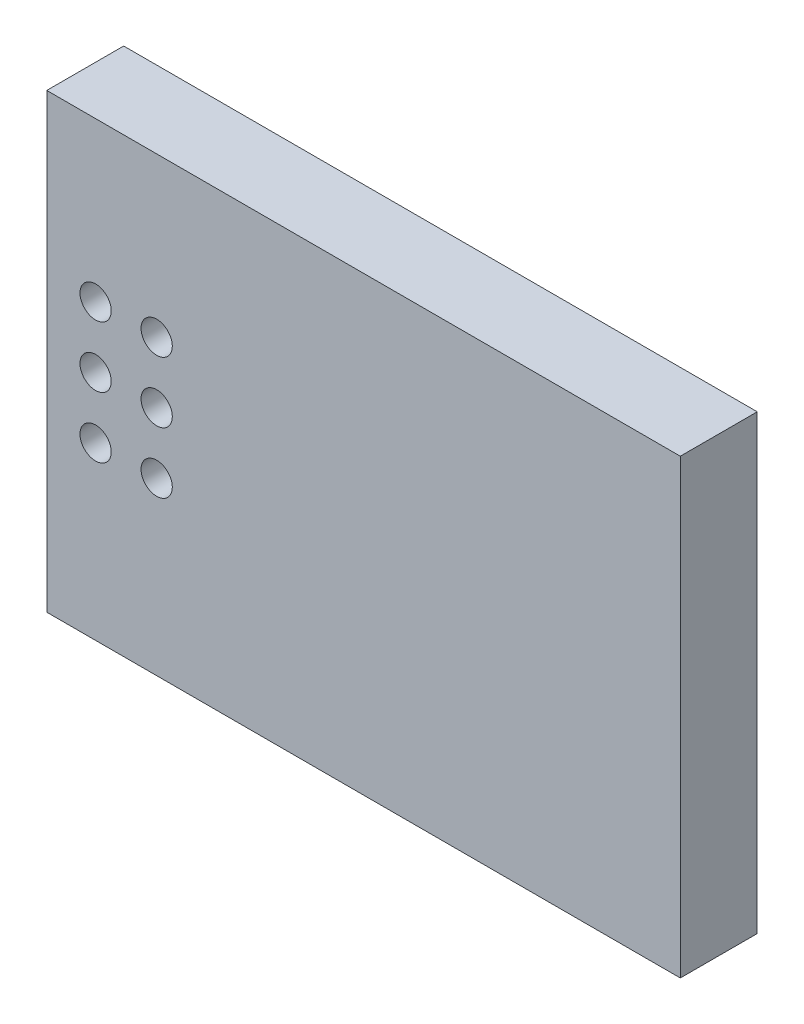
ISO-10303-21;
HEADER;
FILE_DESCRIPTION(('STEP AP214'),'2;1');
FILE_NAME('part.step','',(''),(''),'','','');
FILE_SCHEMA(('AUTOMOTIVE_DESIGN { 1 0 10303 214 1 1 1 1 }'));
ENDSEC;
DATA;
#1=APPLICATION_CONTEXT('core data for automotive mechanical design processes');
#2=APPLICATION_PROTOCOL_DEFINITION('international standard','automotive_design',2000,#1);
#3=PRODUCT_CONTEXT('',#1,'mechanical');
#4=PRODUCT('Part','Part','',(#3));
#5=PRODUCT_RELATED_PRODUCT_CATEGORY('part','',(#4));
#6=PRODUCT_DEFINITION_FORMATION('','',#4);
#7=PRODUCT_DEFINITION_CONTEXT('part definition',#1,'design');
#8=PRODUCT_DEFINITION('design','',#6,#7);
#9=PRODUCT_DEFINITION_SHAPE('','',#8);
#10=(LENGTH_UNIT() NAMED_UNIT(*) SI_UNIT(.MILLI.,.METRE.));
#11=(NAMED_UNIT(*) PLANE_ANGLE_UNIT() SI_UNIT($,.RADIAN.));
#12=(NAMED_UNIT(*) SI_UNIT($,.STERADIAN.) SOLID_ANGLE_UNIT());
#13=UNCERTAINTY_MEASURE_WITH_UNIT(LENGTH_MEASURE(1.E-05),#10,'distance_accuracy_value','');
#14=(GEOMETRIC_REPRESENTATION_CONTEXT(3) GLOBAL_UNCERTAINTY_ASSIGNED_CONTEXT((#13)) GLOBAL_UNIT_ASSIGNED_CONTEXT((#10,
#11,#12)) REPRESENTATION_CONTEXT('',''));
#15=CARTESIAN_POINT('',(0.,0.,0.));
#16=DIRECTION('',(0.,0.,1.));
#17=DIRECTION('',(1.,0.,0.));
#18=AXIS2_PLACEMENT_3D('',#15,#16,#17);
#19=CARTESIAN_POINT('',(158.242,-110.617,1.6));
#20=DIRECTION('',(0.,0.,1.));
#21=DIRECTION('',(1.,0.,0.));
#22=AXIS2_PLACEMENT_3D('',#19,#20,#21);
#23=PLANE('',#22);
#24=CARTESIAN_POINT('',(154.94,-109.22,1.6));
#25=DIRECTION('',(0.,0.,1.));
#26=DIRECTION('',(1.,0.,0.));
#27=AXIS2_PLACEMENT_3D('',#24,#25,#26);
#28=CIRCLE('',#27,0.324999999999993);
#29=CARTESIAN_POINT('',(155.265,-109.22,1.6));
#30=VERTEX_POINT('',#29);
#31=EDGE_CURVE('E106',#30,#30,#28,.F.);
#32=ORIENTED_EDGE('',*,*,#31,.T.);
#33=EDGE_LOOP('',(#32));
#34=FACE_BOUND('',#33,.T.);
#35=CARTESIAN_POINT('',(154.94,-110.49,1.6));
#36=DIRECTION('',(0.,0.,1.));
#37=DIRECTION('',(1.,0.,0.));
#38=AXIS2_PLACEMENT_3D('',#35,#36,#37);
#39=CIRCLE('',#38,0.324999999999993);
#40=CARTESIAN_POINT('',(155.265,-110.49,1.6));
#41=VERTEX_POINT('',#40);
#42=EDGE_CURVE('E104',#41,#41,#39,.F.);
#43=ORIENTED_EDGE('',*,*,#42,.T.);
#44=EDGE_LOOP('',(#43));
#45=FACE_BOUND('',#44,.T.);
#46=CARTESIAN_POINT('',(153.67,-109.22,1.6));
#47=DIRECTION('',(0.,0.,1.));
#48=DIRECTION('',(1.,0.,0.));
#49=AXIS2_PLACEMENT_3D('',#46,#47,#48);
#50=CIRCLE('',#49,0.324999999999993);
#51=CARTESIAN_POINT('',(153.995,-109.22,1.6));
#52=VERTEX_POINT('',#51);
#53=EDGE_CURVE('E20',#52,#52,#50,.F.);
#54=ORIENTED_EDGE('',*,*,#53,.T.);
#55=EDGE_LOOP('',(#54));
#56=FACE_BOUND('',#55,.T.);
#57=CARTESIAN_POINT('',(153.67,-111.76,1.6));
#58=DIRECTION('',(0.,0.,1.));
#59=DIRECTION('',(1.,0.,0.));
#60=AXIS2_PLACEMENT_3D('',#57,#58,#59);
#61=CIRCLE('',#60,0.324999999999993);
#62=CARTESIAN_POINT('',(153.995,-111.76,1.6));
#63=VERTEX_POINT('',#62);
#64=EDGE_CURVE('E98',#63,#63,#61,.F.);
#65=ORIENTED_EDGE('',*,*,#64,.T.);
#66=EDGE_LOOP('',(#65));
#67=FACE_BOUND('',#66,.T.);
#68=CARTESIAN_POINT('',(153.67,-110.49,1.6));
#69=DIRECTION('',(0.,0.,1.));
#70=DIRECTION('',(1.,0.,0.));
#71=AXIS2_PLACEMENT_3D('',#68,#69,#70);
#72=CIRCLE('',#71,0.324999999999993);
#73=CARTESIAN_POINT('',(153.995,-110.49,1.6));
#74=VERTEX_POINT('',#73);
#75=EDGE_CURVE('E95',#74,#74,#72,.F.);
#76=ORIENTED_EDGE('',*,*,#75,.T.);
#77=EDGE_LOOP('',(#76));
#78=FACE_BOUND('',#77,.T.);
#79=CARTESIAN_POINT('',(154.94,-111.76,1.6));
#80=DIRECTION('',(0.,0.,1.));
#81=DIRECTION('',(1.,0.,0.));
#82=AXIS2_PLACEMENT_3D('',#79,#80,#81);
#83=CIRCLE('',#82,0.324999999999993);
#84=CARTESIAN_POINT('',(155.265,-111.76,1.6));
#85=VERTEX_POINT('',#84);
#86=EDGE_CURVE('E101',#85,#85,#83,.F.);
#87=ORIENTED_EDGE('',*,*,#86,.T.);
#88=EDGE_LOOP('',(#87));
#89=FACE_BOUND('',#88,.T.);
#90=DIRECTION('',(1.,0.,0.));
#91=VECTOR('',#90,1.);
#92=CARTESIAN_POINT('',(163.83,-105.918,1.6));
#93=LINE('',#92,#91);
#94=CARTESIAN_POINT('',(165.83,-105.918,1.6));
#95=VERTEX_POINT('',#94);
#96=CARTESIAN_POINT('',(152.654,-105.918,1.6));
#97=VERTEX_POINT('',#96);
#98=EDGE_CURVE('E56',#95,#97,#93,.F.);
#99=ORIENTED_EDGE('',*,*,#98,.T.);
#100=DIRECTION('',(0.,1.,0.));
#101=VECTOR('',#100,1.);
#102=CARTESIAN_POINT('',(152.654,-105.918,1.6));
#103=LINE('',#102,#101);
#104=CARTESIAN_POINT('',(152.654,-115.316,1.6));
#105=VERTEX_POINT('',#104);
#106=EDGE_CURVE('E120',#97,#105,#103,.F.);
#107=ORIENTED_EDGE('',*,*,#106,.T.);
#108=DIRECTION('',(1.,0.,0.));
#109=VECTOR('',#108,1.);
#110=CARTESIAN_POINT('',(152.654,-115.316,1.6));
#111=LINE('',#110,#109);
#112=CARTESIAN_POINT('',(165.83,-115.316,1.6));
#113=VERTEX_POINT('',#112);
#114=EDGE_CURVE('E60',#105,#113,#111,.T.);
#115=ORIENTED_EDGE('',*,*,#114,.T.);
#116=DIRECTION('',(0.,1.,0.));
#117=VECTOR('',#116,1.);
#118=CARTESIAN_POINT('',(165.83,0.,1.6));
#119=LINE('',#118,#117);
#120=EDGE_CURVE('E59',#95,#113,#119,.F.);
#121=ORIENTED_EDGE('',*,*,#120,.F.);
#122=EDGE_LOOP('',(#99,#107,#115,#121));
#123=FACE_BOUND('',#122,.T.);
#124=ADVANCED_FACE('F17',(#34,#45,#56,#67,#78,#89,#123),#23,.T.);
#125=CARTESIAN_POINT('',(165.83,0.,0.));
#126=DIRECTION('',(1.,0.,0.));
#127=DIRECTION('',(0.,0.,-1.));
#128=AXIS2_PLACEMENT_3D('',#125,#126,#127);
#129=PLANE('',#128);
#130=ORIENTED_EDGE('',*,*,#120,.T.);
#131=DIRECTION('',(0.,0.,1.));
#132=VECTOR('',#131,1.);
#133=CARTESIAN_POINT('',(165.83,-115.316,0.));
#134=LINE('',#133,#132);
#135=CARTESIAN_POINT('',(165.83,-115.316,0.));
#136=VERTEX_POINT('',#135);
#137=EDGE_CURVE('E111',#113,#136,#134,.F.);
#138=ORIENTED_EDGE('',*,*,#137,.T.);
#139=DIRECTION('',(0.,1.,0.));
#140=VECTOR('',#139,1.);
#141=CARTESIAN_POINT('',(165.83,-110.617,0.));
#142=LINE('',#141,#140);
#143=CARTESIAN_POINT('',(165.83,-105.918,0.));
#144=VERTEX_POINT('',#143);
#145=EDGE_CURVE('E76',#136,#144,#142,.T.);
#146=ORIENTED_EDGE('',*,*,#145,.T.);
#147=DIRECTION('',(0.,0.,-1.));
#148=VECTOR('',#147,1.);
#149=CARTESIAN_POINT('',(165.83,-105.918,0.));
#150=LINE('',#149,#148);
#151=EDGE_CURVE('E65',#144,#95,#150,.F.);
#152=ORIENTED_EDGE('',*,*,#151,.T.);
#153=EDGE_LOOP('',(#130,#138,#146,#152));
#154=FACE_BOUND('',#153,.T.);
#155=ADVANCED_FACE('F75',(#154),#129,.T.);
#156=CARTESIAN_POINT('',(163.83,-105.918,0.));
#157=DIRECTION('',(0.,-1.,0.));
#158=DIRECTION('',(0.,0.,-1.));
#159=AXIS2_PLACEMENT_3D('',#156,#157,#158);
#160=PLANE('',#159);
#161=ORIENTED_EDGE('',*,*,#98,.F.);
#162=ORIENTED_EDGE('',*,*,#151,.F.);
#163=DIRECTION('',(1.,0.,0.));
#164=VECTOR('',#163,1.);
#165=CARTESIAN_POINT('',(158.242,-105.918,0.));
#166=LINE('',#165,#164);
#167=CARTESIAN_POINT('',(152.654,-105.918,0.));
#168=VERTEX_POINT('',#167);
#169=EDGE_CURVE('E128',#144,#168,#166,.F.);
#170=ORIENTED_EDGE('',*,*,#169,.T.);
#171=DIRECTION('',(0.,0.,-1.));
#172=VECTOR('',#171,1.);
#173=CARTESIAN_POINT('',(152.654,-105.918,0.));
#174=LINE('',#173,#172);
#175=EDGE_CURVE('E72',#168,#97,#174,.F.);
#176=ORIENTED_EDGE('',*,*,#175,.T.);
#177=EDGE_LOOP('',(#161,#162,#170,#176));
#178=FACE_BOUND('',#177,.T.);
#179=ADVANCED_FACE('F69',(#178),#160,.F.);
#180=CARTESIAN_POINT('',(152.654,-105.918,0.));
#181=DIRECTION('',(1.,0.,0.));
#182=DIRECTION('',(0.,0.,-1.));
#183=AXIS2_PLACEMENT_3D('',#180,#181,#182);
#184=PLANE('',#183);
#185=ORIENTED_EDGE('',*,*,#106,.F.);
#186=ORIENTED_EDGE('',*,*,#175,.F.);
#187=DIRECTION('',(0.,1.,0.));
#188=VECTOR('',#187,1.);
#189=CARTESIAN_POINT('',(152.654,-110.617,0.));
#190=LINE('',#189,#188);
#191=CARTESIAN_POINT('',(152.654,-115.316,0.));
#192=VERTEX_POINT('',#191);
#193=EDGE_CURVE('E126',#168,#192,#190,.F.);
#194=ORIENTED_EDGE('',*,*,#193,.T.);
#195=DIRECTION('',(0.,0.,1.));
#196=VECTOR('',#195,1.);
#197=CARTESIAN_POINT('',(152.654,-115.316,0.));
#198=LINE('',#197,#196);
#199=EDGE_CURVE('E35',#192,#105,#198,.T.);
#200=ORIENTED_EDGE('',*,*,#199,.T.);
#201=EDGE_LOOP('',(#185,#186,#194,#200));
#202=FACE_BOUND('',#201,.T.);
#203=ADVANCED_FACE('F124',(#202),#184,.F.);
#204=CARTESIAN_POINT('',(152.654,-115.316,0.));
#205=DIRECTION('',(0.,1.,0.));
#206=DIRECTION('',(0.,0.,1.));
#207=AXIS2_PLACEMENT_3D('',#204,#205,#206);
#208=PLANE('',#207);
#209=ORIENTED_EDGE('',*,*,#137,.F.);
#210=ORIENTED_EDGE('',*,*,#114,.F.);
#211=ORIENTED_EDGE('',*,*,#199,.F.);
#212=DIRECTION('',(1.,0.,0.));
#213=VECTOR('',#212,1.);
#214=CARTESIAN_POINT('',(158.242,-115.316,0.));
#215=LINE('',#214,#213);
#216=EDGE_CURVE('E94',#192,#136,#215,.T.);
#217=ORIENTED_EDGE('',*,*,#216,.T.);
#218=EDGE_LOOP('',(#209,#210,#211,#217));
#219=FACE_BOUND('',#218,.T.);
#220=ADVANCED_FACE('F122',(#219),#208,.F.);
#221=CARTESIAN_POINT('',(153.67,-109.22,-0.8));
#222=DIRECTION('',(0.,0.,1.));
#223=DIRECTION('',(1.,0.,0.));
#224=AXIS2_PLACEMENT_3D('',#221,#222,#223);
#225=CYLINDRICAL_SURFACE('',#224,0.324999999999993);
#226=ORIENTED_EDGE('',*,*,#53,.F.);
#227=EDGE_LOOP('',(#226));
#228=FACE_BOUND('',#227,.T.);
#229=CARTESIAN_POINT('',(153.67,-109.22,0.));
#230=DIRECTION('',(0.,0.,1.));
#231=DIRECTION('',(1.,0.,0.));
#232=AXIS2_PLACEMENT_3D('',#229,#230,#231);
#233=CIRCLE('',#232,0.324999999999993);
#234=CARTESIAN_POINT('',(153.995,-109.22,0.));
#235=VERTEX_POINT('',#234);
#236=EDGE_CURVE('E91',#235,#235,#233,.F.);
#237=ORIENTED_EDGE('',*,*,#236,.T.);
#238=EDGE_LOOP('',(#237));
#239=FACE_BOUND('',#238,.T.);
#240=ADVANCED_FACE('F160',(#228,#239),#225,.F.);
#241=CARTESIAN_POINT('',(154.94,-109.22,-0.8));
#242=DIRECTION('',(0.,0.,1.));
#243=DIRECTION('',(1.,0.,0.));
#244=AXIS2_PLACEMENT_3D('',#241,#242,#243);
#245=CYLINDRICAL_SURFACE('',#244,0.324999999999993);
#246=ORIENTED_EDGE('',*,*,#31,.F.);
#247=EDGE_LOOP('',(#246));
#248=FACE_BOUND('',#247,.T.);
#249=CARTESIAN_POINT('',(154.94,-109.22,0.));
#250=DIRECTION('',(0.,0.,1.));
#251=DIRECTION('',(1.,0.,0.));
#252=AXIS2_PLACEMENT_3D('',#249,#250,#251);
#253=CIRCLE('',#252,0.324999999999993);
#254=CARTESIAN_POINT('',(155.265,-109.22,0.));
#255=VERTEX_POINT('',#254);
#256=EDGE_CURVE('E88',#255,#255,#253,.F.);
#257=ORIENTED_EDGE('',*,*,#256,.T.);
#258=EDGE_LOOP('',(#257));
#259=FACE_BOUND('',#258,.T.);
#260=ADVANCED_FACE('F156',(#248,#259),#245,.F.);
#261=CARTESIAN_POINT('',(154.94,-110.49,-0.8));
#262=DIRECTION('',(0.,0.,1.));
#263=DIRECTION('',(1.,0.,0.));
#264=AXIS2_PLACEMENT_3D('',#261,#262,#263);
#265=CYLINDRICAL_SURFACE('',#264,0.324999999999993);
#266=ORIENTED_EDGE('',*,*,#42,.F.);
#267=EDGE_LOOP('',(#266));
#268=FACE_BOUND('',#267,.T.);
#269=CARTESIAN_POINT('',(154.94,-110.49,0.));
#270=DIRECTION('',(0.,0.,1.));
#271=DIRECTION('',(1.,0.,0.));
#272=AXIS2_PLACEMENT_3D('',#269,#270,#271);
#273=CIRCLE('',#272,0.324999999999993);
#274=CARTESIAN_POINT('',(155.265,-110.49,0.));
#275=VERTEX_POINT('',#274);
#276=EDGE_CURVE('E85',#275,#275,#273,.F.);
#277=ORIENTED_EDGE('',*,*,#276,.T.);
#278=EDGE_LOOP('',(#277));
#279=FACE_BOUND('',#278,.T.);
#280=ADVANCED_FACE('F152',(#268,#279),#265,.F.);
#281=CARTESIAN_POINT('',(154.94,-111.76,-0.8));
#282=DIRECTION('',(0.,0.,1.));
#283=DIRECTION('',(1.,0.,0.));
#284=AXIS2_PLACEMENT_3D('',#281,#282,#283);
#285=CYLINDRICAL_SURFACE('',#284,0.324999999999993);
#286=ORIENTED_EDGE('',*,*,#86,.F.);
#287=EDGE_LOOP('',(#286));
#288=FACE_BOUND('',#287,.T.);
#289=CARTESIAN_POINT('',(154.94,-111.76,0.));
#290=DIRECTION('',(0.,0.,1.));
#291=DIRECTION('',(1.,0.,0.));
#292=AXIS2_PLACEMENT_3D('',#289,#290,#291);
#293=CIRCLE('',#292,0.324999999999993);
#294=CARTESIAN_POINT('',(155.265,-111.76,0.));
#295=VERTEX_POINT('',#294);
#296=EDGE_CURVE('E82',#295,#295,#293,.F.);
#297=ORIENTED_EDGE('',*,*,#296,.T.);
#298=EDGE_LOOP('',(#297));
#299=FACE_BOUND('',#298,.T.);
#300=ADVANCED_FACE('F148',(#288,#299),#285,.F.);
#301=CARTESIAN_POINT('',(153.67,-111.76,-0.8));
#302=DIRECTION('',(0.,0.,1.));
#303=DIRECTION('',(1.,0.,0.));
#304=AXIS2_PLACEMENT_3D('',#301,#302,#303);
#305=CYLINDRICAL_SURFACE('',#304,0.324999999999993);
#306=ORIENTED_EDGE('',*,*,#64,.F.);
#307=EDGE_LOOP('',(#306));
#308=FACE_BOUND('',#307,.T.);
#309=CARTESIAN_POINT('',(153.67,-111.76,0.));
#310=DIRECTION('',(0.,0.,1.));
#311=DIRECTION('',(1.,0.,0.));
#312=AXIS2_PLACEMENT_3D('',#309,#310,#311);
#313=CIRCLE('',#312,0.324999999999993);
#314=CARTESIAN_POINT('',(153.995,-111.76,0.));
#315=VERTEX_POINT('',#314);
#316=EDGE_CURVE('E26',#315,#315,#313,.F.);
#317=ORIENTED_EDGE('',*,*,#316,.T.);
#318=EDGE_LOOP('',(#317));
#319=FACE_BOUND('',#318,.T.);
#320=ADVANCED_FACE('F140',(#308,#319),#305,.F.);
#321=CARTESIAN_POINT('',(153.67,-110.49,-0.8));
#322=DIRECTION('',(0.,0.,1.));
#323=DIRECTION('',(1.,0.,0.));
#324=AXIS2_PLACEMENT_3D('',#321,#322,#323);
#325=CYLINDRICAL_SURFACE('',#324,0.324999999999993);
#326=ORIENTED_EDGE('',*,*,#75,.F.);
#327=EDGE_LOOP('',(#326));
#328=FACE_BOUND('',#327,.T.);
#329=CARTESIAN_POINT('',(153.67,-110.49,0.));
#330=DIRECTION('',(0.,0.,1.));
#331=DIRECTION('',(1.,0.,0.));
#332=AXIS2_PLACEMENT_3D('',#329,#330,#331);
#333=CIRCLE('',#332,0.324999999999993);
#334=CARTESIAN_POINT('',(153.995,-110.49,0.));
#335=VERTEX_POINT('',#334);
#336=EDGE_CURVE('E11',#335,#335,#333,.F.);
#337=ORIENTED_EDGE('',*,*,#336,.T.);
#338=EDGE_LOOP('',(#337));
#339=FACE_BOUND('',#338,.T.);
#340=ADVANCED_FACE('F133',(#328,#339),#325,.F.);
#341=CARTESIAN_POINT('',(158.242,-110.617,0.));
#342=DIRECTION('',(0.,0.,1.));
#343=DIRECTION('',(1.,0.,0.));
#344=AXIS2_PLACEMENT_3D('',#341,#342,#343);
#345=PLANE('',#344);
#346=ORIENTED_EDGE('',*,*,#336,.F.);
#347=EDGE_LOOP('',(#346));
#348=FACE_BOUND('',#347,.T.);
#349=ORIENTED_EDGE('',*,*,#316,.F.);
#350=EDGE_LOOP('',(#349));
#351=FACE_BOUND('',#350,.T.);
#352=ORIENTED_EDGE('',*,*,#296,.F.);
#353=EDGE_LOOP('',(#352));
#354=FACE_BOUND('',#353,.T.);
#355=ORIENTED_EDGE('',*,*,#276,.F.);
#356=EDGE_LOOP('',(#355));
#357=FACE_BOUND('',#356,.T.);
#358=ORIENTED_EDGE('',*,*,#256,.F.);
#359=EDGE_LOOP('',(#358));
#360=FACE_BOUND('',#359,.T.);
#361=ORIENTED_EDGE('',*,*,#236,.F.);
#362=EDGE_LOOP('',(#361));
#363=FACE_BOUND('',#362,.T.);
#364=ORIENTED_EDGE('',*,*,#193,.F.);
#365=ORIENTED_EDGE('',*,*,#169,.F.);
#366=ORIENTED_EDGE('',*,*,#145,.F.);
#367=ORIENTED_EDGE('',*,*,#216,.F.);
#368=EDGE_LOOP('',(#364,#365,#366,#367));
#369=FACE_BOUND('',#368,.T.);
#370=ADVANCED_FACE('F131',(#348,#351,#354,#357,#360,#363,#369),#345,.F.);
#371=CLOSED_SHELL('',(#124,#155,#179,#203,#220,#240,#260,#280,#300,#320,#340,#370));
#372=MANIFOLD_SOLID_BREP('B1',#371);
#373=ADVANCED_BREP_SHAPE_REPRESENTATION('',(#18,#372),#14);
#374=SHAPE_DEFINITION_REPRESENTATION(#9,#373);
ENDSEC;
END-ISO-10303-21;
